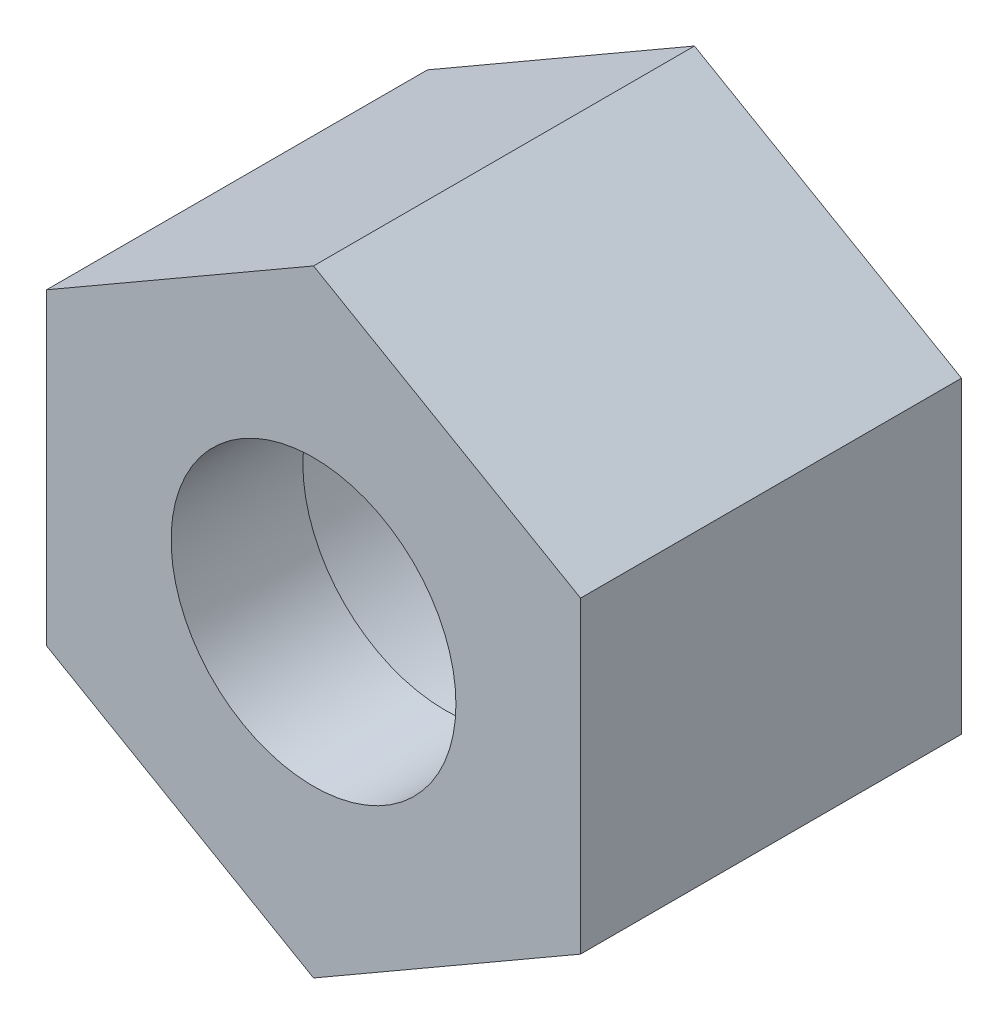
ISO-10303-21;
HEADER;
FILE_DESCRIPTION(('STEP AP214'),'2;1');
FILE_NAME('part.step','',(''),(''),'','','');
FILE_SCHEMA(('AUTOMOTIVE_DESIGN { 1 0 10303 214 1 1 1 1 }'));
ENDSEC;
DATA;
#1=APPLICATION_CONTEXT('core data for automotive mechanical design processes');
#2=APPLICATION_PROTOCOL_DEFINITION('international standard','automotive_design',2000,#1);
#3=PRODUCT_CONTEXT('',#1,'mechanical');
#4=PRODUCT('Part','Part','',(#3));
#5=PRODUCT_RELATED_PRODUCT_CATEGORY('part','',(#4));
#6=PRODUCT_DEFINITION_FORMATION('','',#4);
#7=PRODUCT_DEFINITION_CONTEXT('part definition',#1,'design');
#8=PRODUCT_DEFINITION('design','',#6,#7);
#9=PRODUCT_DEFINITION_SHAPE('','',#8);
#10=(LENGTH_UNIT() NAMED_UNIT(*) SI_UNIT(.MILLI.,.METRE.));
#11=(NAMED_UNIT(*) PLANE_ANGLE_UNIT() SI_UNIT($,.RADIAN.));
#12=(NAMED_UNIT(*) SI_UNIT($,.STERADIAN.) SOLID_ANGLE_UNIT());
#13=UNCERTAINTY_MEASURE_WITH_UNIT(LENGTH_MEASURE(1.E-05),#10,'distance_accuracy_value','');
#14=(GEOMETRIC_REPRESENTATION_CONTEXT(3) GLOBAL_UNCERTAINTY_ASSIGNED_CONTEXT((#13)) GLOBAL_UNIT_ASSIGNED_CONTEXT((#10,
#11,#12)) REPRESENTATION_CONTEXT('',''));
#15=CARTESIAN_POINT('',(0.,0.,0.));
#16=DIRECTION('',(0.,0.,1.));
#17=DIRECTION('',(1.,0.,0.));
#18=AXIS2_PLACEMENT_3D('',#15,#16,#17);
#19=CARTESIAN_POINT('',(15.,8.66025403784439,21.4));
#20=DIRECTION('',(-0.5,-0.866025403784439,0.));
#21=DIRECTION('',(0.866025403784439,-0.5,0.));
#22=AXIS2_PLACEMENT_3D('',#19,#20,#21);
#23=PLANE('',#22);
#24=DIRECTION('',(-0.866025403784439,0.5,0.));
#25=VECTOR('',#24,1.);
#26=CARTESIAN_POINT('',(15.,8.66025403784439,0.));
#27=LINE('',#26,#25);
#28=CARTESIAN_POINT('',(15.,8.66025403784439,0.));
#29=VERTEX_POINT('',#28);
#30=CARTESIAN_POINT('',(0.,17.3205080756888,0.));
#31=VERTEX_POINT('',#30);
#32=EDGE_CURVE('E128',#29,#31,#27,.T.);
#33=ORIENTED_EDGE('',*,*,#32,.T.);
#34=DIRECTION('',(0.,0.,-1.));
#35=VECTOR('',#34,1.);
#36=CARTESIAN_POINT('',(0.,17.3205080756888,21.4));
#37=LINE('',#36,#35);
#38=CARTESIAN_POINT('',(0.,17.3205080756888,21.4));
#39=VERTEX_POINT('',#38);
#40=EDGE_CURVE('E11',#39,#31,#37,.T.);
#41=ORIENTED_EDGE('',*,*,#40,.F.);
#42=DIRECTION('',(-0.866025403784439,0.5,0.));
#43=VECTOR('',#42,1.);
#44=CARTESIAN_POINT('',(15.,8.66025403784439,21.4));
#45=LINE('',#44,#43);
#46=CARTESIAN_POINT('',(15.,8.66025403784439,21.4));
#47=VERTEX_POINT('',#46);
#48=EDGE_CURVE('E139',#47,#39,#45,.T.);
#49=ORIENTED_EDGE('',*,*,#48,.F.);
#50=DIRECTION('',(0.,0.,-1.));
#51=VECTOR('',#50,1.);
#52=CARTESIAN_POINT('',(15.,8.66025403784439,21.4));
#53=LINE('',#52,#51);
#54=EDGE_CURVE('E124',#47,#29,#53,.T.);
#55=ORIENTED_EDGE('',*,*,#54,.T.);
#56=EDGE_LOOP('',(#33,#41,#49,#55));
#57=FACE_BOUND('',#56,.T.);
#58=ADVANCED_FACE('F43',(#57),#23,.F.);
#59=CARTESIAN_POINT('',(0.,17.3205080756888,21.4));
#60=DIRECTION('',(0.5,-0.866025403784439,0.));
#61=DIRECTION('',(0.866025403784439,0.5,0.));
#62=AXIS2_PLACEMENT_3D('',#59,#60,#61);
#63=PLANE('',#62);
#64=DIRECTION('',(-0.866025403784439,-0.5,0.));
#65=VECTOR('',#64,1.);
#66=CARTESIAN_POINT('',(0.,17.3205080756888,0.));
#67=LINE('',#66,#65);
#68=CARTESIAN_POINT('',(-15.,8.66025403784439,0.));
#69=VERTEX_POINT('',#68);
#70=EDGE_CURVE('E131',#31,#69,#67,.T.);
#71=ORIENTED_EDGE('',*,*,#70,.T.);
#72=DIRECTION('',(0.,0.,-1.));
#73=VECTOR('',#72,1.);
#74=CARTESIAN_POINT('',(-15.,8.66025403784439,21.4));
#75=LINE('',#74,#73);
#76=CARTESIAN_POINT('',(-15.,8.66025403784439,21.4));
#77=VERTEX_POINT('',#76);
#78=EDGE_CURVE('E52',#77,#69,#75,.T.);
#79=ORIENTED_EDGE('',*,*,#78,.F.);
#80=DIRECTION('',(-0.866025403784439,-0.5,0.));
#81=VECTOR('',#80,1.);
#82=CARTESIAN_POINT('',(0.,17.3205080756888,21.4));
#83=LINE('',#82,#81);
#84=EDGE_CURVE('E97',#39,#77,#83,.T.);
#85=ORIENTED_EDGE('',*,*,#84,.F.);
#86=ORIENTED_EDGE('',*,*,#40,.T.);
#87=EDGE_LOOP('',(#71,#79,#85,#86));
#88=FACE_BOUND('',#87,.T.);
#89=ADVANCED_FACE('F165',(#88),#63,.F.);
#90=CARTESIAN_POINT('',(-15.,8.66025403784439,21.4));
#91=DIRECTION('',(1.,0.,0.));
#92=DIRECTION('',(0.,0.,-1.));
#93=AXIS2_PLACEMENT_3D('',#90,#91,#92);
#94=PLANE('',#93);
#95=DIRECTION('',(0.,-1.,0.));
#96=VECTOR('',#95,1.);
#97=CARTESIAN_POINT('',(-15.,8.66025403784439,0.));
#98=LINE('',#97,#96);
#99=CARTESIAN_POINT('',(-15.,-8.66025403784439,0.));
#100=VERTEX_POINT('',#99);
#101=EDGE_CURVE('E134',#69,#100,#98,.T.);
#102=ORIENTED_EDGE('',*,*,#101,.T.);
#103=DIRECTION('',(0.,0.,-1.));
#104=VECTOR('',#103,1.);
#105=CARTESIAN_POINT('',(-15.,-8.66025403784439,21.4));
#106=LINE('',#105,#104);
#107=CARTESIAN_POINT('',(-15.,-8.66025403784439,21.4));
#108=VERTEX_POINT('',#107);
#109=EDGE_CURVE('E119',#108,#100,#106,.T.);
#110=ORIENTED_EDGE('',*,*,#109,.F.);
#111=DIRECTION('',(0.,-1.,0.));
#112=VECTOR('',#111,1.);
#113=CARTESIAN_POINT('',(-15.,8.66025403784439,21.4));
#114=LINE('',#113,#112);
#115=EDGE_CURVE('E110',#77,#108,#114,.T.);
#116=ORIENTED_EDGE('',*,*,#115,.F.);
#117=ORIENTED_EDGE('',*,*,#78,.T.);
#118=EDGE_LOOP('',(#102,#110,#116,#117));
#119=FACE_BOUND('',#118,.T.);
#120=ADVANCED_FACE('F146',(#119),#94,.F.);
#121=CARTESIAN_POINT('',(-15.,-8.66025403784439,21.4));
#122=DIRECTION('',(0.5,0.866025403784438,0.));
#123=DIRECTION('',(-0.866025403784439,0.5,0.));
#124=AXIS2_PLACEMENT_3D('',#121,#122,#123);
#125=PLANE('',#124);
#126=DIRECTION('',(0.866025403784439,-0.5,0.));
#127=VECTOR('',#126,1.);
#128=CARTESIAN_POINT('',(-15.,-8.66025403784439,0.));
#129=LINE('',#128,#127);
#130=CARTESIAN_POINT('',(0.,-17.3205080756888,0.));
#131=VERTEX_POINT('',#130);
#132=EDGE_CURVE('E118',#100,#131,#129,.T.);
#133=ORIENTED_EDGE('',*,*,#132,.T.);
#134=DIRECTION('',(0.,0.,-1.));
#135=VECTOR('',#134,1.);
#136=CARTESIAN_POINT('',(0.,-17.3205080756888,21.4));
#137=LINE('',#136,#135);
#138=CARTESIAN_POINT('',(0.,-17.3205080756888,21.4));
#139=VERTEX_POINT('',#138);
#140=EDGE_CURVE('E115',#139,#131,#137,.T.);
#141=ORIENTED_EDGE('',*,*,#140,.F.);
#142=DIRECTION('',(0.866025403784439,-0.5,0.));
#143=VECTOR('',#142,1.);
#144=CARTESIAN_POINT('',(-15.,-8.66025403784439,21.4));
#145=LINE('',#144,#143);
#146=EDGE_CURVE('E104',#108,#139,#145,.T.);
#147=ORIENTED_EDGE('',*,*,#146,.F.);
#148=ORIENTED_EDGE('',*,*,#109,.T.);
#149=EDGE_LOOP('',(#133,#141,#147,#148));
#150=FACE_BOUND('',#149,.T.);
#151=ADVANCED_FACE('F116',(#150),#125,.F.);
#152=CARTESIAN_POINT('',(0.,-17.3205080756888,21.4));
#153=DIRECTION('',(-0.5,0.866025403784439,0.));
#154=DIRECTION('',(-0.866025403784439,-0.5,0.));
#155=AXIS2_PLACEMENT_3D('',#152,#153,#154);
#156=PLANE('',#155);
#157=DIRECTION('',(0.866025403784439,0.5,0.));
#158=VECTOR('',#157,1.);
#159=CARTESIAN_POINT('',(0.,-17.3205080756888,0.));
#160=LINE('',#159,#158);
#161=CARTESIAN_POINT('',(15.,-8.6602540378444,0.));
#162=VERTEX_POINT('',#161);
#163=EDGE_CURVE('E83',#131,#162,#160,.T.);
#164=ORIENTED_EDGE('',*,*,#163,.T.);
#165=DIRECTION('',(0.,0.,-1.));
#166=VECTOR('',#165,1.);
#167=CARTESIAN_POINT('',(15.,-8.6602540378444,21.4));
#168=LINE('',#167,#166);
#169=CARTESIAN_POINT('',(15.,-8.6602540378444,21.4));
#170=VERTEX_POINT('',#169);
#171=EDGE_CURVE('E120',#170,#162,#168,.T.);
#172=ORIENTED_EDGE('',*,*,#171,.F.);
#173=DIRECTION('',(0.866025403784439,0.5,0.));
#174=VECTOR('',#173,1.);
#175=CARTESIAN_POINT('',(0.,-17.3205080756888,21.4));
#176=LINE('',#175,#174);
#177=EDGE_CURVE('E108',#139,#170,#176,.T.);
#178=ORIENTED_EDGE('',*,*,#177,.F.);
#179=ORIENTED_EDGE('',*,*,#140,.T.);
#180=EDGE_LOOP('',(#164,#172,#178,#179));
#181=FACE_BOUND('',#180,.T.);
#182=ADVANCED_FACE('F122',(#181),#156,.F.);
#183=CARTESIAN_POINT('',(15.,-8.6602540378444,21.4));
#184=DIRECTION('',(-1.,0.,0.));
#185=DIRECTION('',(0.,0.,1.));
#186=AXIS2_PLACEMENT_3D('',#183,#184,#185);
#187=PLANE('',#186);
#188=DIRECTION('',(0.,1.,0.));
#189=VECTOR('',#188,1.);
#190=CARTESIAN_POINT('',(15.,-8.6602540378444,0.));
#191=LINE('',#190,#189);
#192=EDGE_CURVE('E89',#162,#29,#191,.T.);
#193=ORIENTED_EDGE('',*,*,#192,.T.);
#194=ORIENTED_EDGE('',*,*,#54,.F.);
#195=DIRECTION('',(0.,1.,0.));
#196=VECTOR('',#195,1.);
#197=CARTESIAN_POINT('',(15.,-8.6602540378444,21.4));
#198=LINE('',#197,#196);
#199=EDGE_CURVE('E60',#170,#47,#198,.T.);
#200=ORIENTED_EDGE('',*,*,#199,.F.);
#201=ORIENTED_EDGE('',*,*,#171,.T.);
#202=EDGE_LOOP('',(#193,#194,#200,#201));
#203=FACE_BOUND('',#202,.T.);
#204=ADVANCED_FACE('F153',(#203),#187,.F.);
#205=CARTESIAN_POINT('',(-15.,25.9807621135332,21.4));
#206=DIRECTION('',(0.,0.,1.));
#207=DIRECTION('',(1.,0.,0.));
#208=AXIS2_PLACEMENT_3D('',#205,#206,#207);
#209=PLANE('',#208);
#210=CARTESIAN_POINT('',(0.,0.,21.4));
#211=DIRECTION('',(0.,0.,1.));
#212=DIRECTION('',(1.,0.,0.));
#213=AXIS2_PLACEMENT_3D('',#210,#211,#212);
#214=CIRCLE('',#213,8.);
#215=CARTESIAN_POINT('',(8.,0.,21.4));
#216=VERTEX_POINT('',#215);
#217=EDGE_CURVE('E298',#216,#216,#214,.T.);
#218=ORIENTED_EDGE('',*,*,#217,.F.);
#219=EDGE_LOOP('',(#218));
#220=FACE_BOUND('',#219,.T.);
#221=ORIENTED_EDGE('',*,*,#48,.T.);
#222=ORIENTED_EDGE('',*,*,#84,.T.);
#223=ORIENTED_EDGE('',*,*,#115,.T.);
#224=ORIENTED_EDGE('',*,*,#146,.T.);
#225=ORIENTED_EDGE('',*,*,#177,.T.);
#226=ORIENTED_EDGE('',*,*,#199,.T.);
#227=EDGE_LOOP('',(#221,#222,#223,#224,#225,#226));
#228=FACE_BOUND('',#227,.T.);
#229=ADVANCED_FACE('F106',(#220,#228),#209,.T.);
#230=CARTESIAN_POINT('',(-15.,25.9807621135332,0.));
#231=DIRECTION('',(0.,0.,1.));
#232=DIRECTION('',(1.,0.,0.));
#233=AXIS2_PLACEMENT_3D('',#230,#231,#232);
#234=PLANE('',#233);
#235=CARTESIAN_POINT('',(0.,0.,0.));
#236=DIRECTION('',(0.,0.,-1.));
#237=DIRECTION('',(-1.,0.,0.));
#238=AXIS2_PLACEMENT_3D('',#235,#236,#237);
#239=CIRCLE('',#238,11.25);
#240=CARTESIAN_POINT('',(-11.25,0.,0.));
#241=VERTEX_POINT('',#240);
#242=EDGE_CURVE('E300',#241,#241,#239,.T.);
#243=ORIENTED_EDGE('',*,*,#242,.F.);
#244=EDGE_LOOP('',(#243));
#245=FACE_BOUND('',#244,.T.);
#246=ORIENTED_EDGE('',*,*,#32,.F.);
#247=ORIENTED_EDGE('',*,*,#192,.F.);
#248=ORIENTED_EDGE('',*,*,#163,.F.);
#249=ORIENTED_EDGE('',*,*,#132,.F.);
#250=ORIENTED_EDGE('',*,*,#101,.F.);
#251=ORIENTED_EDGE('',*,*,#70,.F.);
#252=EDGE_LOOP('',(#246,#247,#248,#249,#250,#251));
#253=FACE_BOUND('',#252,.T.);
#254=ADVANCED_FACE('F149',(#245,#253),#234,.F.);
#255=CARTESIAN_POINT('',(0.,0.,14.));
#256=DIRECTION('',(0.,0.,-1.));
#257=DIRECTION('',(-1.,0.,0.));
#258=AXIS2_PLACEMENT_3D('',#255,#256,#257);
#259=CYLINDRICAL_SURFACE('',#258,11.25);
#260=CARTESIAN_POINT('',(0.,0.,14.));
#261=DIRECTION('',(0.,0.,-1.));
#262=DIRECTION('',(-1.,0.,0.));
#263=AXIS2_PLACEMENT_3D('',#260,#261,#262);
#264=CIRCLE('',#263,11.25);
#265=CARTESIAN_POINT('',(-11.25,0.,14.));
#266=VERTEX_POINT('',#265);
#267=EDGE_CURVE('E132',#266,#266,#264,.T.);
#268=ORIENTED_EDGE('',*,*,#267,.F.);
#269=EDGE_LOOP('',(#268));
#270=FACE_BOUND('',#269,.T.);
#271=ORIENTED_EDGE('',*,*,#242,.T.);
#272=EDGE_LOOP('',(#271));
#273=FACE_BOUND('',#272,.T.);
#274=ADVANCED_FACE('F204',(#270,#273),#259,.F.);
#275=CARTESIAN_POINT('',(0.,0.,14.));
#276=DIRECTION('',(0.,0.,-1.));
#277=DIRECTION('',(-1.,0.,0.));
#278=AXIS2_PLACEMENT_3D('',#275,#276,#277);
#279=PLANE('',#278);
#280=CARTESIAN_POINT('',(0.,0.,14.));
#281=DIRECTION('',(0.,0.,-1.));
#282=DIRECTION('',(-1.,0.,0.));
#283=AXIS2_PLACEMENT_3D('',#280,#281,#282);
#284=CIRCLE('',#283,8.);
#285=CARTESIAN_POINT('',(-8.,0.,14.));
#286=VERTEX_POINT('',#285);
#287=EDGE_CURVE('E46',#286,#286,#284,.T.);
#288=ORIENTED_EDGE('',*,*,#287,.F.);
#289=EDGE_LOOP('',(#288));
#290=FACE_BOUND('',#289,.T.);
#291=ORIENTED_EDGE('',*,*,#267,.T.);
#292=EDGE_LOOP('',(#291));
#293=FACE_BOUND('',#292,.T.);
#294=ADVANCED_FACE('F212',(#290,#293),#279,.T.);
#295=CARTESIAN_POINT('',(0.,0.,0.));
#296=DIRECTION('',(0.,0.,1.));
#297=DIRECTION('',(1.,0.,0.));
#298=AXIS2_PLACEMENT_3D('',#295,#296,#297);
#299=CYLINDRICAL_SURFACE('',#298,8.);
#300=ORIENTED_EDGE('',*,*,#287,.T.);
#301=EDGE_LOOP('',(#300));
#302=FACE_BOUND('',#301,.T.);
#303=ORIENTED_EDGE('',*,*,#217,.T.);
#304=EDGE_LOOP('',(#303));
#305=FACE_BOUND('',#304,.T.);
#306=ADVANCED_FACE('F221',(#302,#305),#299,.F.);
#307=CLOSED_SHELL('',(#58,#89,#120,#151,#182,#204,#229,#254,#274,#294,#306));
#308=MANIFOLD_SOLID_BREP('B2',#307);
#309=ADVANCED_BREP_SHAPE_REPRESENTATION('',(#18,#308),#14);
#310=SHAPE_DEFINITION_REPRESENTATION(#9,#309);
ENDSEC;
END-ISO-10303-21;
